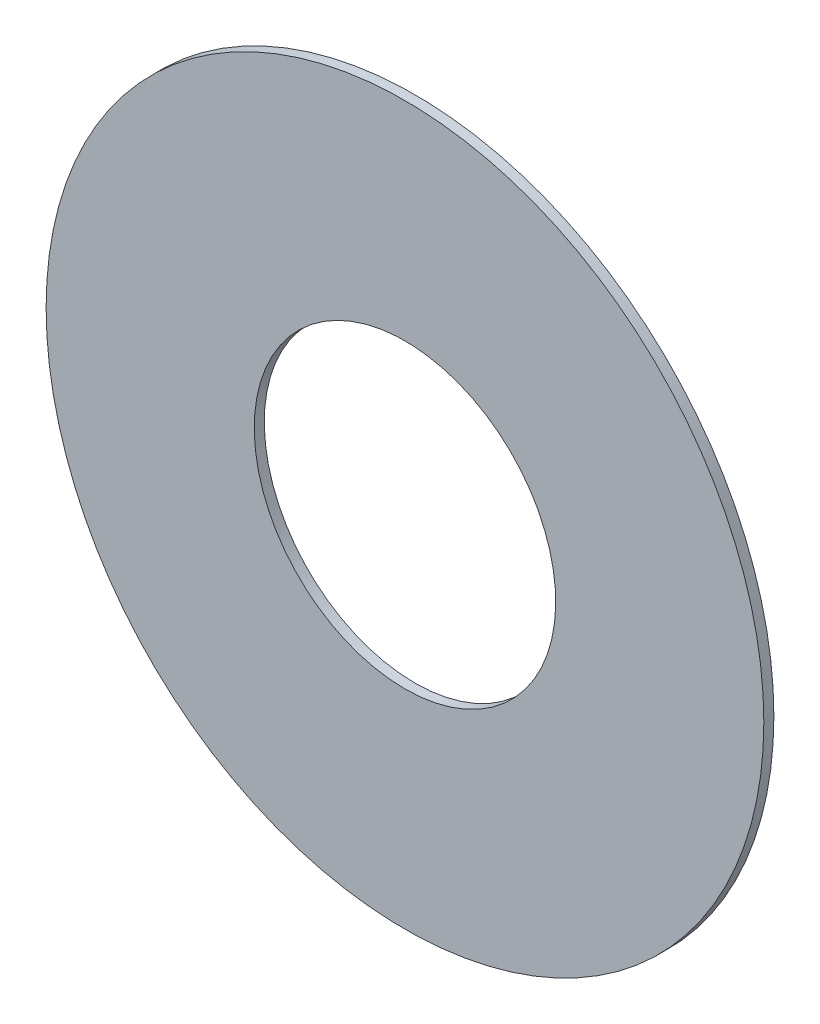
ISO-10303-21;
HEADER;
FILE_DESCRIPTION(('STEP AP214'),'2;1');
FILE_NAME('part.step','',(''),(''),'','','');
FILE_SCHEMA(('AUTOMOTIVE_DESIGN { 1 0 10303 214 1 1 1 1 }'));
ENDSEC;
DATA;
#1=APPLICATION_CONTEXT('core data for automotive mechanical design processes');
#2=APPLICATION_PROTOCOL_DEFINITION('international standard','automotive_design',2000,#1);
#3=PRODUCT_CONTEXT('',#1,'mechanical');
#4=PRODUCT('Part','Part','',(#3));
#5=PRODUCT_RELATED_PRODUCT_CATEGORY('part','',(#4));
#6=PRODUCT_DEFINITION_FORMATION('','',#4);
#7=PRODUCT_DEFINITION_CONTEXT('part definition',#1,'design');
#8=PRODUCT_DEFINITION('design','',#6,#7);
#9=PRODUCT_DEFINITION_SHAPE('','',#8);
#10=(LENGTH_UNIT() NAMED_UNIT(*) SI_UNIT(.MILLI.,.METRE.));
#11=(NAMED_UNIT(*) PLANE_ANGLE_UNIT() SI_UNIT($,.RADIAN.));
#12=(NAMED_UNIT(*) SI_UNIT($,.STERADIAN.) SOLID_ANGLE_UNIT());
#13=UNCERTAINTY_MEASURE_WITH_UNIT(LENGTH_MEASURE(1.E-05),#10,'distance_accuracy_value','');
#14=(GEOMETRIC_REPRESENTATION_CONTEXT(3) GLOBAL_UNCERTAINTY_ASSIGNED_CONTEXT((#13)) GLOBAL_UNIT_ASSIGNED_CONTEXT((#10,
#11,#12)) REPRESENTATION_CONTEXT('',''));
#15=CARTESIAN_POINT('',(0.,0.,0.));
#16=DIRECTION('',(0.,0.,1.));
#17=DIRECTION('',(1.,0.,0.));
#18=AXIS2_PLACEMENT_3D('',#15,#16,#17);
#19=CARTESIAN_POINT('',(158.952,-121.234,-0.045));
#20=DIRECTION('',(0.,0.,-1.));
#21=DIRECTION('',(0.,-1.,0.));
#22=AXIS2_PLACEMENT_3D('',#19,#20,#21);
#23=CYLINDRICAL_SURFACE('',#22,0.525);
#24=CARTESIAN_POINT('',(158.952,-121.234,-0.035));
#25=DIRECTION('',(0.,0.,-1.));
#26=DIRECTION('',(0.,-1.,0.));
#27=AXIS2_PLACEMENT_3D('',#24,#25,#26);
#28=CIRCLE('',#27,0.525);
#29=CARTESIAN_POINT('',(158.952,-121.759,-0.035));
#30=VERTEX_POINT('',#29);
#31=EDGE_CURVE('E26',#30,#30,#28,.T.);
#32=ORIENTED_EDGE('',*,*,#31,.T.);
#33=DIRECTION('',(0.,0.,1.));
#34=VECTOR('',#33,1.);
#35=CARTESIAN_POINT('',(158.952,-121.759,-0.045));
#36=LINE('',#35,#34);
#37=CARTESIAN_POINT('',(158.952,-121.759,0.));
#38=VERTEX_POINT('',#37);
#39=EDGE_CURVE('E11',#30,#38,#36,.T.);
#40=ORIENTED_EDGE('',*,*,#39,.T.);
#41=CARTESIAN_POINT('',(158.952,-121.234,0.));
#42=DIRECTION('',(0.,0.,-1.));
#43=DIRECTION('',(0.,-1.,0.));
#44=AXIS2_PLACEMENT_3D('',#41,#42,#43);
#45=CIRCLE('',#44,0.525);
#46=EDGE_CURVE('E20',#38,#38,#45,.T.);
#47=ORIENTED_EDGE('',*,*,#46,.F.);
#48=ORIENTED_EDGE('',*,*,#39,.F.);
#49=EDGE_LOOP('',(#32,#40,#47,#48));
#50=FACE_BOUND('',#49,.T.);
#51=ADVANCED_FACE('F17',(#50),#23,.F.);
#52=CARTESIAN_POINT('',(158.952,-121.234,-0.035));
#53=DIRECTION('',(0.,0.,1.));
#54=DIRECTION('',(1.,0.,0.));
#55=AXIS2_PLACEMENT_3D('',#52,#53,#54);
#56=PLANE('',#55);
#57=ORIENTED_EDGE('',*,*,#31,.F.);
#58=EDGE_LOOP('',(#57));
#59=FACE_BOUND('',#58,.T.);
#60=CARTESIAN_POINT('',(158.952,-121.234,-0.035));
#61=DIRECTION('',(0.,0.,1.));
#62=DIRECTION('',(1.,0.,0.));
#63=AXIS2_PLACEMENT_3D('',#60,#61,#62);
#64=CIRCLE('',#63,1.25);
#65=CARTESIAN_POINT('',(160.202,-121.234,-0.035));
#66=VERTEX_POINT('',#65);
#67=EDGE_CURVE('E57',#66,#66,#64,.T.);
#68=ORIENTED_EDGE('',*,*,#67,.F.);
#69=EDGE_LOOP('',(#68));
#70=FACE_BOUND('',#69,.T.);
#71=ADVANCED_FACE('F81',(#59,#70),#56,.F.);
#72=CARTESIAN_POINT('',(158.952,-121.234,0.));
#73=DIRECTION('',(0.,0.,1.));
#74=DIRECTION('',(1.,0.,0.));
#75=AXIS2_PLACEMENT_3D('',#72,#73,#74);
#76=PLANE('',#75);
#77=ORIENTED_EDGE('',*,*,#46,.T.);
#78=EDGE_LOOP('',(#77));
#79=FACE_BOUND('',#78,.T.);
#80=CARTESIAN_POINT('',(158.952,-121.234,0.));
#81=DIRECTION('',(0.,0.,1.));
#82=DIRECTION('',(1.,0.,0.));
#83=AXIS2_PLACEMENT_3D('',#80,#81,#82);
#84=CIRCLE('',#83,1.25);
#85=CARTESIAN_POINT('',(160.202,-121.234,0.));
#86=VERTEX_POINT('',#85);
#87=EDGE_CURVE('E55',#86,#86,#84,.T.);
#88=ORIENTED_EDGE('',*,*,#87,.T.);
#89=EDGE_LOOP('',(#88));
#90=FACE_BOUND('',#89,.T.);
#91=ADVANCED_FACE('F61',(#79,#90),#76,.T.);
#92=CARTESIAN_POINT('',(158.952,-121.234,-0.035));
#93=DIRECTION('',(0.,0.,1.));
#94=DIRECTION('',(1.,0.,0.));
#95=AXIS2_PLACEMENT_3D('',#92,#93,#94);
#96=CYLINDRICAL_SURFACE('',#95,1.25);
#97=ORIENTED_EDGE('',*,*,#87,.F.);
#98=DIRECTION('',(0.,0.,1.));
#99=VECTOR('',#98,1.);
#100=CARTESIAN_POINT('',(160.202,-121.234,-0.035));
#101=LINE('',#100,#99);
#102=EDGE_CURVE('E52',#66,#86,#101,.T.);
#103=ORIENTED_EDGE('',*,*,#102,.F.);
#104=ORIENTED_EDGE('',*,*,#67,.T.);
#105=ORIENTED_EDGE('',*,*,#102,.T.);
#106=EDGE_LOOP('',(#97,#103,#104,#105));
#107=FACE_BOUND('',#106,.T.);
#108=ADVANCED_FACE('F54',(#107),#96,.T.);
#109=CLOSED_SHELL('',(#51,#71,#91,#108));
#110=MANIFOLD_SOLID_BREP('B1',#109);
#111=ADVANCED_BREP_SHAPE_REPRESENTATION('',(#18,#110),#14);
#112=SHAPE_DEFINITION_REPRESENTATION(#9,#111);
ENDSEC;
END-ISO-10303-21;
